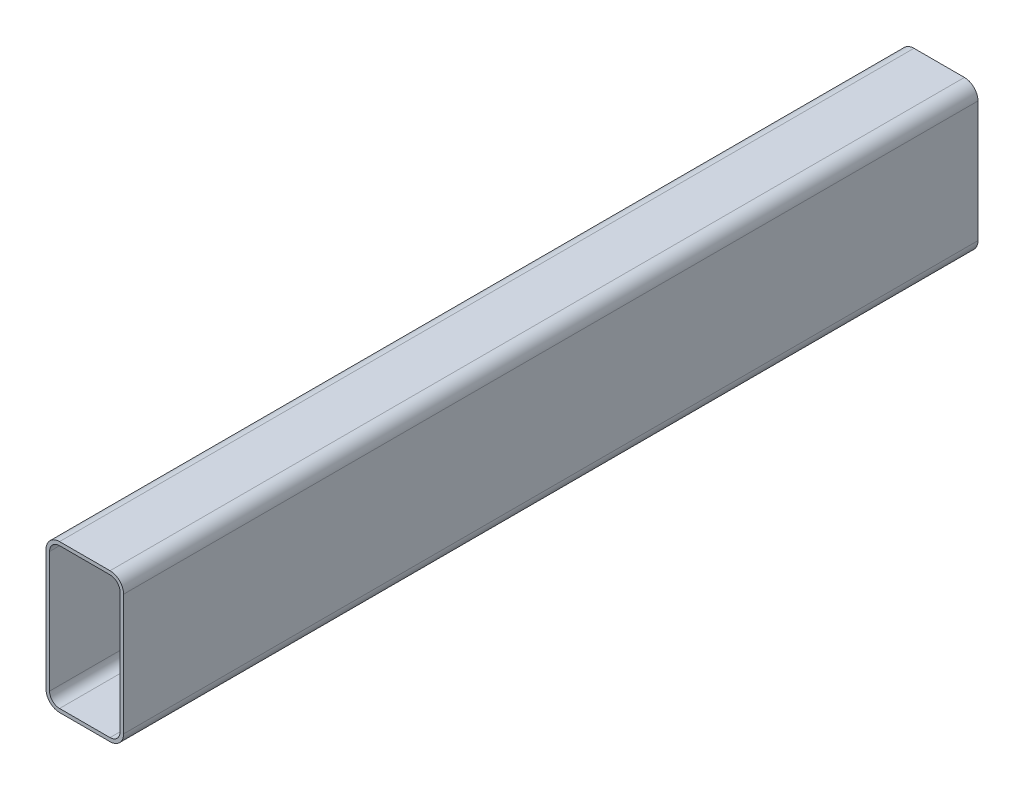
ISO-10303-21;
HEADER;
FILE_DESCRIPTION(('STEP AP214'),'2;1');
FILE_NAME('part.step','',(''),(''),'','','');
FILE_SCHEMA(('AUTOMOTIVE_DESIGN { 1 0 10303 214 1 1 1 1 }'));
ENDSEC;
DATA;
#1=APPLICATION_CONTEXT('core data for automotive mechanical design processes');
#2=APPLICATION_PROTOCOL_DEFINITION('international standard','automotive_design',2000,#1);
#3=PRODUCT_CONTEXT('',#1,'mechanical');
#4=PRODUCT('Part','Part','',(#3));
#5=PRODUCT_RELATED_PRODUCT_CATEGORY('part','',(#4));
#6=PRODUCT_DEFINITION_FORMATION('','',#4);
#7=PRODUCT_DEFINITION_CONTEXT('part definition',#1,'design');
#8=PRODUCT_DEFINITION('design','',#6,#7);
#9=PRODUCT_DEFINITION_SHAPE('','',#8);
#10=(LENGTH_UNIT() NAMED_UNIT(*) SI_UNIT(.MILLI.,.METRE.));
#11=(NAMED_UNIT(*) PLANE_ANGLE_UNIT() SI_UNIT($,.RADIAN.));
#12=(NAMED_UNIT(*) SI_UNIT($,.STERADIAN.) SOLID_ANGLE_UNIT());
#13=UNCERTAINTY_MEASURE_WITH_UNIT(LENGTH_MEASURE(1.E-05),#10,'distance_accuracy_value','');
#14=(GEOMETRIC_REPRESENTATION_CONTEXT(3) GLOBAL_UNCERTAINTY_ASSIGNED_CONTEXT((#13)) GLOBAL_UNIT_ASSIGNED_CONTEXT((#10,
#11,#12)) REPRESENTATION_CONTEXT('',''));
#15=CARTESIAN_POINT('',(0.,0.,0.));
#16=DIRECTION('',(0.,0.,1.));
#17=DIRECTION('',(1.,0.,0.));
#18=AXIS2_PLACEMENT_3D('',#15,#16,#17);
#19=CARTESIAN_POINT('',(9.001125,26.416,152.4));
#20=DIRECTION('',(0.,-1.,0.));
#21=DIRECTION('',(0.,0.,-1.));
#22=AXIS2_PLACEMENT_3D('',#19,#20,#21);
#23=PLANE('',#22);
#24=DIRECTION('',(0.,0.,-1.));
#25=VECTOR('',#24,1.);
#26=CARTESIAN_POINT('',(-9.001125,26.416,152.4));
#27=LINE('',#26,#25);
#28=CARTESIAN_POINT('',(-9.001125,26.416,152.4));
#29=VERTEX_POINT('',#28);
#30=CARTESIAN_POINT('',(-9.001125,26.416,-152.4));
#31=VERTEX_POINT('',#30);
#32=EDGE_CURVE('E118',#29,#31,#27,.T.);
#33=ORIENTED_EDGE('',*,*,#32,.F.);
#34=DIRECTION('',(1.,0.,0.));
#35=VECTOR('',#34,1.);
#36=CARTESIAN_POINT('',(9.001125,26.416,152.4));
#37=LINE('',#36,#35);
#38=CARTESIAN_POINT('',(9.001125,26.416,152.4));
#39=VERTEX_POINT('',#38);
#40=EDGE_CURVE('E115',#39,#29,#37,.F.);
#41=ORIENTED_EDGE('',*,*,#40,.F.);
#42=DIRECTION('',(0.,0.,-1.));
#43=VECTOR('',#42,1.);
#44=CARTESIAN_POINT('',(9.001125,26.416,152.4));
#45=LINE('',#44,#43);
#46=CARTESIAN_POINT('',(9.001125,26.416,-152.4));
#47=VERTEX_POINT('',#46);
#48=EDGE_CURVE('E103',#47,#39,#45,.F.);
#49=ORIENTED_EDGE('',*,*,#48,.F.);
#50=DIRECTION('',(1.,0.,0.));
#51=VECTOR('',#50,1.);
#52=CARTESIAN_POINT('',(9.001125,26.416,-152.4));
#53=LINE('',#52,#51);
#54=EDGE_CURVE('E188',#47,#31,#53,.F.);
#55=ORIENTED_EDGE('',*,*,#54,.T.);
#56=EDGE_LOOP('',(#33,#41,#49,#55));
#57=FACE_BOUND('',#56,.T.);
#58=ADVANCED_FACE('F15',(#57),#23,.F.);
#59=CARTESIAN_POINT('',(-9.001125,-26.416,152.4));
#60=DIRECTION('',(0.,1.,0.));
#61=DIRECTION('',(0.,0.,1.));
#62=AXIS2_PLACEMENT_3D('',#59,#60,#61);
#63=PLANE('',#62);
#64=DIRECTION('',(0.,0.,-1.));
#65=VECTOR('',#64,1.);
#66=CARTESIAN_POINT('',(9.001125,-26.416,152.4));
#67=LINE('',#66,#65);
#68=CARTESIAN_POINT('',(9.001125,-26.416,152.4));
#69=VERTEX_POINT('',#68);
#70=CARTESIAN_POINT('',(9.001125,-26.416,-152.4));
#71=VERTEX_POINT('',#70);
#72=EDGE_CURVE('E153',#69,#71,#67,.T.);
#73=ORIENTED_EDGE('',*,*,#72,.F.);
#74=DIRECTION('',(1.,0.,0.));
#75=VECTOR('',#74,1.);
#76=CARTESIAN_POINT('',(9.001125,-26.416,152.4));
#77=LINE('',#76,#75);
#78=CARTESIAN_POINT('',(-9.001125,-26.416,152.4));
#79=VERTEX_POINT('',#78);
#80=EDGE_CURVE('E122',#79,#69,#77,.T.);
#81=ORIENTED_EDGE('',*,*,#80,.F.);
#82=DIRECTION('',(0.,0.,-1.));
#83=VECTOR('',#82,1.);
#84=CARTESIAN_POINT('',(-9.001125,-26.416,152.4));
#85=LINE('',#84,#83);
#86=CARTESIAN_POINT('',(-9.001125,-26.416,-152.4));
#87=VERTEX_POINT('',#86);
#88=EDGE_CURVE('E156',#87,#79,#85,.F.);
#89=ORIENTED_EDGE('',*,*,#88,.F.);
#90=DIRECTION('',(1.,0.,0.));
#91=VECTOR('',#90,1.);
#92=CARTESIAN_POINT('',(9.001125,-26.416,-152.4));
#93=LINE('',#92,#91);
#94=EDGE_CURVE('E183',#87,#71,#93,.T.);
#95=ORIENTED_EDGE('',*,*,#94,.T.);
#96=EDGE_LOOP('',(#73,#81,#89,#95));
#97=FACE_BOUND('',#96,.T.);
#98=ADVANCED_FACE('F211',(#97),#63,.F.);
#99=CARTESIAN_POINT('',(9.001125,-21.574125,152.4));
#100=DIRECTION('',(0.,0.,-1.));
#101=DIRECTION('',(-1.,0.,0.));
#102=AXIS2_PLACEMENT_3D('',#99,#100,#101);
#103=CYLINDRICAL_SURFACE('',#102,4.841875);
#104=CARTESIAN_POINT('',(9.001125,-21.574125,152.4));
#105=DIRECTION('',(0.,0.,-1.));
#106=DIRECTION('',(-1.,0.,0.));
#107=AXIS2_PLACEMENT_3D('',#104,#105,#106);
#108=CIRCLE('',#107,4.841875);
#109=CARTESIAN_POINT('',(13.843,-21.574125,152.4));
#110=VERTEX_POINT('',#109);
#111=EDGE_CURVE('E203',#69,#110,#108,.F.);
#112=ORIENTED_EDGE('',*,*,#111,.F.);
#113=ORIENTED_EDGE('',*,*,#72,.T.);
#114=CARTESIAN_POINT('',(9.001125,-21.574125,-152.4));
#115=DIRECTION('',(0.,0.,-1.));
#116=DIRECTION('',(-1.,0.,0.));
#117=AXIS2_PLACEMENT_3D('',#114,#115,#116);
#118=CIRCLE('',#117,4.841875);
#119=CARTESIAN_POINT('',(13.843,-21.574125,-152.4));
#120=VERTEX_POINT('',#119);
#121=EDGE_CURVE('E180',#71,#120,#118,.F.);
#122=ORIENTED_EDGE('',*,*,#121,.T.);
#123=DIRECTION('',(0.,0.,1.));
#124=VECTOR('',#123,1.);
#125=CARTESIAN_POINT('',(13.843,-21.574125,152.4));
#126=LINE('',#125,#124);
#127=EDGE_CURVE('E111',#120,#110,#126,.T.);
#128=ORIENTED_EDGE('',*,*,#127,.T.);
#129=EDGE_LOOP('',(#112,#113,#122,#128));
#130=FACE_BOUND('',#129,.T.);
#131=ADVANCED_FACE('F214',(#130),#103,.T.);
#132=CARTESIAN_POINT('',(13.843,21.574125,152.4));
#133=DIRECTION('',(-1.,0.,0.));
#134=DIRECTION('',(0.,0.,1.));
#135=AXIS2_PLACEMENT_3D('',#132,#133,#134);
#136=PLANE('',#135);
#137=DIRECTION('',(0.,0.,-1.));
#138=VECTOR('',#137,1.);
#139=CARTESIAN_POINT('',(13.843,21.574125,152.4));
#140=LINE('',#139,#138);
#141=CARTESIAN_POINT('',(13.843,21.574125,152.4));
#142=VERTEX_POINT('',#141);
#143=CARTESIAN_POINT('',(13.843,21.574125,-152.4));
#144=VERTEX_POINT('',#143);
#145=EDGE_CURVE('E96',#142,#144,#140,.T.);
#146=ORIENTED_EDGE('',*,*,#145,.F.);
#147=DIRECTION('',(0.,1.,0.));
#148=VECTOR('',#147,1.);
#149=CARTESIAN_POINT('',(13.843,21.574125,152.4));
#150=LINE('',#149,#148);
#151=EDGE_CURVE('E117',#110,#142,#150,.T.);
#152=ORIENTED_EDGE('',*,*,#151,.F.);
#153=ORIENTED_EDGE('',*,*,#127,.F.);
#154=DIRECTION('',(0.,1.,0.));
#155=VECTOR('',#154,1.);
#156=CARTESIAN_POINT('',(13.843,21.574125,-152.4));
#157=LINE('',#156,#155);
#158=EDGE_CURVE('E179',#120,#144,#157,.T.);
#159=ORIENTED_EDGE('',*,*,#158,.T.);
#160=EDGE_LOOP('',(#146,#152,#153,#159));
#161=FACE_BOUND('',#160,.T.);
#162=ADVANCED_FACE('F217',(#161),#136,.F.);
#163=CARTESIAN_POINT('',(9.001125,21.574125,152.4));
#164=DIRECTION('',(0.,0.,-1.));
#165=DIRECTION('',(-1.,0.,0.));
#166=AXIS2_PLACEMENT_3D('',#163,#164,#165);
#167=CYLINDRICAL_SURFACE('',#166,4.841875);
#168=CARTESIAN_POINT('',(9.001125,21.574125,152.4));
#169=DIRECTION('',(0.,0.,-1.));
#170=DIRECTION('',(-1.,0.,0.));
#171=AXIS2_PLACEMENT_3D('',#168,#169,#170);
#172=CIRCLE('',#171,4.841875);
#173=EDGE_CURVE('E18',#142,#39,#172,.F.);
#174=ORIENTED_EDGE('',*,*,#173,.F.);
#175=ORIENTED_EDGE('',*,*,#145,.T.);
#176=CARTESIAN_POINT('',(9.001125,21.574125,-152.4));
#177=DIRECTION('',(0.,0.,-1.));
#178=DIRECTION('',(-1.,0.,0.));
#179=AXIS2_PLACEMENT_3D('',#176,#177,#178);
#180=CIRCLE('',#179,4.841875);
#181=EDGE_CURVE('E107',#144,#47,#180,.F.);
#182=ORIENTED_EDGE('',*,*,#181,.T.);
#183=ORIENTED_EDGE('',*,*,#48,.T.);
#184=EDGE_LOOP('',(#174,#175,#182,#183));
#185=FACE_BOUND('',#184,.T.);
#186=ADVANCED_FACE('F105',(#185),#167,.T.);
#187=CARTESIAN_POINT('',(9.001125,25.146,152.4));
#188=DIRECTION('',(0.,-1.,0.));
#189=DIRECTION('',(0.,0.,-1.));
#190=AXIS2_PLACEMENT_3D('',#187,#188,#189);
#191=PLANE('',#190);
#192=DIRECTION('',(1.,0.,0.));
#193=VECTOR('',#192,1.);
#194=CARTESIAN_POINT('',(9.001125,25.146,152.4));
#195=LINE('',#194,#193);
#196=CARTESIAN_POINT('',(-9.001125,25.146,152.4));
#197=VERTEX_POINT('',#196);
#198=CARTESIAN_POINT('',(9.001125,25.146,152.4));
#199=VERTEX_POINT('',#198);
#200=EDGE_CURVE('E198',#197,#199,#195,.T.);
#201=ORIENTED_EDGE('',*,*,#200,.F.);
#202=DIRECTION('',(0.,0.,-1.));
#203=VECTOR('',#202,1.);
#204=CARTESIAN_POINT('',(-9.001125,25.146,152.4));
#205=LINE('',#204,#203);
#206=CARTESIAN_POINT('',(-9.001125,25.146,-152.4));
#207=VERTEX_POINT('',#206);
#208=EDGE_CURVE('E126',#197,#207,#205,.T.);
#209=ORIENTED_EDGE('',*,*,#208,.T.);
#210=DIRECTION('',(1.,0.,0.));
#211=VECTOR('',#210,1.);
#212=CARTESIAN_POINT('',(9.001125,25.146,-152.4));
#213=LINE('',#212,#211);
#214=CARTESIAN_POINT('',(9.001125,25.146,-152.4));
#215=VERTEX_POINT('',#214);
#216=EDGE_CURVE('E177',#207,#215,#213,.T.);
#217=ORIENTED_EDGE('',*,*,#216,.T.);
#218=DIRECTION('',(0.,0.,-1.));
#219=VECTOR('',#218,1.);
#220=CARTESIAN_POINT('',(9.001125,25.146,152.4));
#221=LINE('',#220,#219);
#222=EDGE_CURVE('E147',#215,#199,#221,.F.);
#223=ORIENTED_EDGE('',*,*,#222,.T.);
#224=EDGE_LOOP('',(#201,#209,#217,#223));
#225=FACE_BOUND('',#224,.T.);
#226=ADVANCED_FACE('F225',(#225),#191,.T.);
#227=CARTESIAN_POINT('',(9.001125,21.574125,152.4));
#228=DIRECTION('',(0.,0.,-1.));
#229=DIRECTION('',(-1.,0.,0.));
#230=AXIS2_PLACEMENT_3D('',#227,#228,#229);
#231=CYLINDRICAL_SURFACE('',#230,3.571875);
#232=DIRECTION('',(0.,0.,1.));
#233=VECTOR('',#232,1.);
#234=CARTESIAN_POINT('',(12.573,21.574125,152.4));
#235=LINE('',#234,#233);
#236=CARTESIAN_POINT('',(12.573,21.574125,152.4));
#237=VERTEX_POINT('',#236);
#238=CARTESIAN_POINT('',(12.573,21.574125,-152.4));
#239=VERTEX_POINT('',#238);
#240=EDGE_CURVE('E144',#237,#239,#235,.F.);
#241=ORIENTED_EDGE('',*,*,#240,.F.);
#242=CARTESIAN_POINT('',(9.001125,21.574125,152.4));
#243=DIRECTION('',(0.,0.,-1.));
#244=DIRECTION('',(-1.,0.,0.));
#245=AXIS2_PLACEMENT_3D('',#242,#243,#244);
#246=CIRCLE('',#245,3.571875);
#247=EDGE_CURVE('E196',#199,#237,#246,.T.);
#248=ORIENTED_EDGE('',*,*,#247,.F.);
#249=ORIENTED_EDGE('',*,*,#222,.F.);
#250=CARTESIAN_POINT('',(9.001125,21.574125,-152.4));
#251=DIRECTION('',(0.,0.,-1.));
#252=DIRECTION('',(-1.,0.,0.));
#253=AXIS2_PLACEMENT_3D('',#250,#251,#252);
#254=CIRCLE('',#253,3.571875);
#255=EDGE_CURVE('E174',#215,#239,#254,.T.);
#256=ORIENTED_EDGE('',*,*,#255,.T.);
#257=EDGE_LOOP('',(#241,#248,#249,#256));
#258=FACE_BOUND('',#257,.T.);
#259=ADVANCED_FACE('F274',(#258),#231,.F.);
#260=CARTESIAN_POINT('',(12.573,21.574125,152.4));
#261=DIRECTION('',(-1.,0.,0.));
#262=DIRECTION('',(0.,0.,1.));
#263=AXIS2_PLACEMENT_3D('',#260,#261,#262);
#264=PLANE('',#263);
#265=DIRECTION('',(0.,1.,0.));
#266=VECTOR('',#265,1.);
#267=CARTESIAN_POINT('',(12.573,21.574125,152.4));
#268=LINE('',#267,#266);
#269=CARTESIAN_POINT('',(12.573,-21.574125,152.4));
#270=VERTEX_POINT('',#269);
#271=EDGE_CURVE('E195',#237,#270,#268,.F.);
#272=ORIENTED_EDGE('',*,*,#271,.F.);
#273=ORIENTED_EDGE('',*,*,#240,.T.);
#274=DIRECTION('',(0.,1.,0.));
#275=VECTOR('',#274,1.);
#276=CARTESIAN_POINT('',(12.573,21.574125,-152.4));
#277=LINE('',#276,#275);
#278=CARTESIAN_POINT('',(12.573,-21.574125,-152.4));
#279=VERTEX_POINT('',#278);
#280=EDGE_CURVE('E173',#239,#279,#277,.F.);
#281=ORIENTED_EDGE('',*,*,#280,.T.);
#282=DIRECTION('',(0.,0.,-1.));
#283=VECTOR('',#282,1.);
#284=CARTESIAN_POINT('',(12.573,-21.574125,152.4));
#285=LINE('',#284,#283);
#286=EDGE_CURVE('E141',#279,#270,#285,.F.);
#287=ORIENTED_EDGE('',*,*,#286,.T.);
#288=EDGE_LOOP('',(#272,#273,#281,#287));
#289=FACE_BOUND('',#288,.T.);
#290=ADVANCED_FACE('F270',(#289),#264,.T.);
#291=CARTESIAN_POINT('',(9.001125,-21.574125,152.4));
#292=DIRECTION('',(0.,0.,-1.));
#293=DIRECTION('',(-1.,0.,0.));
#294=AXIS2_PLACEMENT_3D('',#291,#292,#293);
#295=CYLINDRICAL_SURFACE('',#294,3.571875);
#296=DIRECTION('',(0.,0.,1.));
#297=VECTOR('',#296,1.);
#298=CARTESIAN_POINT('',(9.001125,-25.146,152.4));
#299=LINE('',#298,#297);
#300=CARTESIAN_POINT('',(9.001125,-25.146,152.4));
#301=VERTEX_POINT('',#300);
#302=CARTESIAN_POINT('',(9.001125,-25.146,-152.4));
#303=VERTEX_POINT('',#302);
#304=EDGE_CURVE('E138',#301,#303,#299,.F.);
#305=ORIENTED_EDGE('',*,*,#304,.F.);
#306=CARTESIAN_POINT('',(9.001125,-21.574125,152.4));
#307=DIRECTION('',(0.,0.,-1.));
#308=DIRECTION('',(-1.,0.,0.));
#309=AXIS2_PLACEMENT_3D('',#306,#307,#308);
#310=CIRCLE('',#309,3.571875);
#311=EDGE_CURVE('E193',#270,#301,#310,.T.);
#312=ORIENTED_EDGE('',*,*,#311,.F.);
#313=ORIENTED_EDGE('',*,*,#286,.F.);
#314=CARTESIAN_POINT('',(9.001125,-21.574125,-152.4));
#315=DIRECTION('',(0.,0.,-1.));
#316=DIRECTION('',(-1.,0.,0.));
#317=AXIS2_PLACEMENT_3D('',#314,#315,#316);
#318=CIRCLE('',#317,3.571875);
#319=EDGE_CURVE('E170',#279,#303,#318,.T.);
#320=ORIENTED_EDGE('',*,*,#319,.T.);
#321=EDGE_LOOP('',(#305,#312,#313,#320));
#322=FACE_BOUND('',#321,.T.);
#323=ADVANCED_FACE('F266',(#322),#295,.F.);
#324=CARTESIAN_POINT('',(-9.001125,-25.146,152.4));
#325=DIRECTION('',(0.,1.,0.));
#326=DIRECTION('',(0.,0.,1.));
#327=AXIS2_PLACEMENT_3D('',#324,#325,#326);
#328=PLANE('',#327);
#329=DIRECTION('',(1.,0.,0.));
#330=VECTOR('',#329,1.);
#331=CARTESIAN_POINT('',(9.001125,-25.146,152.4));
#332=LINE('',#331,#330);
#333=CARTESIAN_POINT('',(-9.001125,-25.146,152.4));
#334=VERTEX_POINT('',#333);
#335=EDGE_CURVE('E192',#301,#334,#332,.F.);
#336=ORIENTED_EDGE('',*,*,#335,.F.);
#337=ORIENTED_EDGE('',*,*,#304,.T.);
#338=DIRECTION('',(1.,0.,0.));
#339=VECTOR('',#338,1.);
#340=CARTESIAN_POINT('',(9.001125,-25.146,-152.4));
#341=LINE('',#340,#339);
#342=CARTESIAN_POINT('',(-9.001125,-25.146,-152.4));
#343=VERTEX_POINT('',#342);
#344=EDGE_CURVE('E169',#303,#343,#341,.F.);
#345=ORIENTED_EDGE('',*,*,#344,.T.);
#346=DIRECTION('',(0.,0.,-1.));
#347=VECTOR('',#346,1.);
#348=CARTESIAN_POINT('',(-9.001125,-25.146,152.4));
#349=LINE('',#348,#347);
#350=EDGE_CURVE('E135',#343,#334,#349,.F.);
#351=ORIENTED_EDGE('',*,*,#350,.T.);
#352=EDGE_LOOP('',(#336,#337,#345,#351));
#353=FACE_BOUND('',#352,.T.);
#354=ADVANCED_FACE('F262',(#353),#328,.T.);
#355=CARTESIAN_POINT('',(-9.001125,-21.574125,152.4));
#356=DIRECTION('',(0.,0.,-1.));
#357=DIRECTION('',(-1.,0.,0.));
#358=AXIS2_PLACEMENT_3D('',#355,#356,#357);
#359=CYLINDRICAL_SURFACE('',#358,3.571875);
#360=DIRECTION('',(0.,0.,-1.));
#361=VECTOR('',#360,1.);
#362=CARTESIAN_POINT('',(-12.573,-21.574125,152.4));
#363=LINE('',#362,#361);
#364=CARTESIAN_POINT('',(-12.573,-21.574125,152.4));
#365=VERTEX_POINT('',#364);
#366=CARTESIAN_POINT('',(-12.573,-21.574125,-152.4));
#367=VERTEX_POINT('',#366);
#368=EDGE_CURVE('E132',#365,#367,#363,.T.);
#369=ORIENTED_EDGE('',*,*,#368,.F.);
#370=CARTESIAN_POINT('',(-9.001125,-21.574125,152.4));
#371=DIRECTION('',(0.,0.,-1.));
#372=DIRECTION('',(-1.,0.,0.));
#373=AXIS2_PLACEMENT_3D('',#370,#371,#372);
#374=CIRCLE('',#373,3.571875);
#375=EDGE_CURVE('E159',#334,#365,#374,.T.);
#376=ORIENTED_EDGE('',*,*,#375,.F.);
#377=ORIENTED_EDGE('',*,*,#350,.F.);
#378=CARTESIAN_POINT('',(-9.001125,-21.574125,-152.4));
#379=DIRECTION('',(0.,0.,-1.));
#380=DIRECTION('',(-1.,0.,0.));
#381=AXIS2_PLACEMENT_3D('',#378,#379,#380);
#382=CIRCLE('',#381,3.571875);
#383=EDGE_CURVE('E166',#343,#367,#382,.T.);
#384=ORIENTED_EDGE('',*,*,#383,.T.);
#385=EDGE_LOOP('',(#369,#376,#377,#384));
#386=FACE_BOUND('',#385,.T.);
#387=ADVANCED_FACE('F258',(#386),#359,.F.);
#388=CARTESIAN_POINT('',(-12.573,-21.574125,152.4));
#389=DIRECTION('',(1.,0.,0.));
#390=DIRECTION('',(0.,0.,-1.));
#391=AXIS2_PLACEMENT_3D('',#388,#389,#390);
#392=PLANE('',#391);
#393=DIRECTION('',(0.,1.,0.));
#394=VECTOR('',#393,1.);
#395=CARTESIAN_POINT('',(-12.573,21.574125,152.4));
#396=LINE('',#395,#394);
#397=CARTESIAN_POINT('',(-12.573,21.574125,152.4));
#398=VERTEX_POINT('',#397);
#399=EDGE_CURVE('E202',#365,#398,#396,.T.);
#400=ORIENTED_EDGE('',*,*,#399,.F.);
#401=ORIENTED_EDGE('',*,*,#368,.T.);
#402=DIRECTION('',(0.,1.,0.));
#403=VECTOR('',#402,1.);
#404=CARTESIAN_POINT('',(-12.573,21.574125,-152.4));
#405=LINE('',#404,#403);
#406=CARTESIAN_POINT('',(-12.573,21.574125,-152.4));
#407=VERTEX_POINT('',#406);
#408=EDGE_CURVE('E165',#367,#407,#405,.T.);
#409=ORIENTED_EDGE('',*,*,#408,.T.);
#410=DIRECTION('',(0.,0.,-1.));
#411=VECTOR('',#410,1.);
#412=CARTESIAN_POINT('',(-12.573,21.574125,152.4));
#413=LINE('',#412,#411);
#414=EDGE_CURVE('E129',#407,#398,#413,.F.);
#415=ORIENTED_EDGE('',*,*,#414,.T.);
#416=EDGE_LOOP('',(#400,#401,#409,#415));
#417=FACE_BOUND('',#416,.T.);
#418=ADVANCED_FACE('F254',(#417),#392,.T.);
#419=CARTESIAN_POINT('',(-9.001125,21.574125,152.4));
#420=DIRECTION('',(0.,0.,-1.));
#421=DIRECTION('',(-1.,0.,0.));
#422=AXIS2_PLACEMENT_3D('',#419,#420,#421);
#423=CYLINDRICAL_SURFACE('',#422,3.571875);
#424=ORIENTED_EDGE('',*,*,#208,.F.);
#425=CARTESIAN_POINT('',(-9.001125,21.574125,152.4));
#426=DIRECTION('',(0.,0.,-1.));
#427=DIRECTION('',(-1.,0.,0.));
#428=AXIS2_PLACEMENT_3D('',#425,#426,#427);
#429=CIRCLE('',#428,3.571875);
#430=EDGE_CURVE('E199',#398,#197,#429,.T.);
#431=ORIENTED_EDGE('',*,*,#430,.F.);
#432=ORIENTED_EDGE('',*,*,#414,.F.);
#433=CARTESIAN_POINT('',(-9.001125,21.574125,-152.4));
#434=DIRECTION('',(0.,0.,-1.));
#435=DIRECTION('',(-1.,0.,0.));
#436=AXIS2_PLACEMENT_3D('',#433,#434,#435);
#437=CIRCLE('',#436,3.571875);
#438=EDGE_CURVE('E161',#407,#207,#437,.T.);
#439=ORIENTED_EDGE('',*,*,#438,.T.);
#440=EDGE_LOOP('',(#424,#431,#432,#439));
#441=FACE_BOUND('',#440,.T.);
#442=ADVANCED_FACE('F250',(#441),#423,.F.);
#443=CARTESIAN_POINT('',(-9.001125,21.574125,152.4));
#444=DIRECTION('',(0.,0.,-1.));
#445=DIRECTION('',(-1.,0.,0.));
#446=AXIS2_PLACEMENT_3D('',#443,#444,#445);
#447=CYLINDRICAL_SURFACE('',#446,4.841875);
#448=CARTESIAN_POINT('',(-9.001125,21.574125,152.4));
#449=DIRECTION('',(0.,0.,-1.));
#450=DIRECTION('',(-1.,0.,0.));
#451=AXIS2_PLACEMENT_3D('',#448,#449,#450);
#452=CIRCLE('',#451,4.841875);
#453=CARTESIAN_POINT('',(-13.843,21.574125,152.4));
#454=VERTEX_POINT('',#453);
#455=EDGE_CURVE('E120',#29,#454,#452,.F.);
#456=ORIENTED_EDGE('',*,*,#455,.F.);
#457=ORIENTED_EDGE('',*,*,#32,.T.);
#458=CARTESIAN_POINT('',(-9.001125,21.574125,-152.4));
#459=DIRECTION('',(0.,0.,-1.));
#460=DIRECTION('',(-1.,0.,0.));
#461=AXIS2_PLACEMENT_3D('',#458,#459,#460);
#462=CIRCLE('',#461,4.841875);
#463=CARTESIAN_POINT('',(-13.843,21.574125,-152.4));
#464=VERTEX_POINT('',#463);
#465=EDGE_CURVE('E185',#31,#464,#462,.F.);
#466=ORIENTED_EDGE('',*,*,#465,.T.);
#467=DIRECTION('',(0.,0.,-1.));
#468=VECTOR('',#467,1.);
#469=CARTESIAN_POINT('',(-13.843,21.574125,152.4));
#470=LINE('',#469,#468);
#471=EDGE_CURVE('E164',#464,#454,#470,.F.);
#472=ORIENTED_EDGE('',*,*,#471,.T.);
#473=EDGE_LOOP('',(#456,#457,#466,#472));
#474=FACE_BOUND('',#473,.T.);
#475=ADVANCED_FACE('F246',(#474),#447,.T.);
#476=CARTESIAN_POINT('',(9.001125,21.574125,152.4));
#477=DIRECTION('',(0.,0.,1.));
#478=DIRECTION('',(1.,0.,0.));
#479=AXIS2_PLACEMENT_3D('',#476,#477,#478);
#480=PLANE('',#479);
#481=ORIENTED_EDGE('',*,*,#335,.T.);
#482=ORIENTED_EDGE('',*,*,#375,.T.);
#483=ORIENTED_EDGE('',*,*,#399,.T.);
#484=ORIENTED_EDGE('',*,*,#430,.T.);
#485=ORIENTED_EDGE('',*,*,#200,.T.);
#486=ORIENTED_EDGE('',*,*,#247,.T.);
#487=ORIENTED_EDGE('',*,*,#271,.T.);
#488=ORIENTED_EDGE('',*,*,#311,.T.);
#489=EDGE_LOOP('',(#481,#482,#483,#484,#485,#486,#487,#488));
#490=FACE_BOUND('',#489,.T.);
#491=ORIENTED_EDGE('',*,*,#111,.T.);
#492=ORIENTED_EDGE('',*,*,#151,.T.);
#493=ORIENTED_EDGE('',*,*,#173,.T.);
#494=ORIENTED_EDGE('',*,*,#40,.T.);
#495=ORIENTED_EDGE('',*,*,#455,.T.);
#496=DIRECTION('',(0.,1.,0.));
#497=VECTOR('',#496,1.);
#498=CARTESIAN_POINT('',(-13.843,-21.574125,152.4));
#499=LINE('',#498,#497);
#500=CARTESIAN_POINT('',(-13.843,-21.574125,152.4));
#501=VERTEX_POINT('',#500);
#502=EDGE_CURVE('E328',#454,#501,#499,.F.);
#503=ORIENTED_EDGE('',*,*,#502,.T.);
#504=CARTESIAN_POINT('',(-9.001125,-21.574125,152.4));
#505=DIRECTION('',(0.,0.,-1.));
#506=DIRECTION('',(-1.,0.,0.));
#507=AXIS2_PLACEMENT_3D('',#504,#505,#506);
#508=CIRCLE('',#507,4.841875);
#509=EDGE_CURVE('E158',#79,#501,#508,.T.);
#510=ORIENTED_EDGE('',*,*,#509,.F.);
#511=ORIENTED_EDGE('',*,*,#80,.T.);
#512=EDGE_LOOP('',(#491,#492,#493,#494,#495,#503,#510,#511));
#513=FACE_BOUND('',#512,.T.);
#514=ADVANCED_FACE('F114',(#490,#513),#480,.T.);
#515=CARTESIAN_POINT('',(-9.001125,-21.574125,152.4));
#516=DIRECTION('',(0.,0.,-1.));
#517=DIRECTION('',(-1.,0.,0.));
#518=AXIS2_PLACEMENT_3D('',#515,#516,#517);
#519=CYLINDRICAL_SURFACE('',#518,4.841875);
#520=ORIENTED_EDGE('',*,*,#509,.T.);
#521=DIRECTION('',(0.,0.,-1.));
#522=VECTOR('',#521,1.);
#523=CARTESIAN_POINT('',(-13.843,-21.574125,152.4));
#524=LINE('',#523,#522);
#525=CARTESIAN_POINT('',(-13.843,-21.574125,-152.4));
#526=VERTEX_POINT('',#525);
#527=EDGE_CURVE('E24',#501,#526,#524,.T.);
#528=ORIENTED_EDGE('',*,*,#527,.T.);
#529=CARTESIAN_POINT('',(-9.001125,-21.574125,-152.4));
#530=DIRECTION('',(0.,0.,-1.));
#531=DIRECTION('',(-1.,0.,0.));
#532=AXIS2_PLACEMENT_3D('',#529,#530,#531);
#533=CIRCLE('',#532,4.841875);
#534=EDGE_CURVE('E32',#526,#87,#533,.F.);
#535=ORIENTED_EDGE('',*,*,#534,.T.);
#536=ORIENTED_EDGE('',*,*,#88,.T.);
#537=EDGE_LOOP('',(#520,#528,#535,#536));
#538=FACE_BOUND('',#537,.T.);
#539=ADVANCED_FACE('F236',(#538),#519,.T.);
#540=CARTESIAN_POINT('',(9.001125,21.574125,-152.4));
#541=DIRECTION('',(0.,0.,1.));
#542=DIRECTION('',(1.,0.,0.));
#543=AXIS2_PLACEMENT_3D('',#540,#541,#542);
#544=PLANE('',#543);
#545=ORIENTED_EDGE('',*,*,#408,.F.);
#546=ORIENTED_EDGE('',*,*,#383,.F.);
#547=ORIENTED_EDGE('',*,*,#344,.F.);
#548=ORIENTED_EDGE('',*,*,#319,.F.);
#549=ORIENTED_EDGE('',*,*,#280,.F.);
#550=ORIENTED_EDGE('',*,*,#255,.F.);
#551=ORIENTED_EDGE('',*,*,#216,.F.);
#552=ORIENTED_EDGE('',*,*,#438,.F.);
#553=EDGE_LOOP('',(#545,#546,#547,#548,#549,#550,#551,#552));
#554=FACE_BOUND('',#553,.T.);
#555=ORIENTED_EDGE('',*,*,#158,.F.);
#556=ORIENTED_EDGE('',*,*,#121,.F.);
#557=ORIENTED_EDGE('',*,*,#94,.F.);
#558=ORIENTED_EDGE('',*,*,#534,.F.);
#559=DIRECTION('',(0.,1.,0.));
#560=VECTOR('',#559,1.);
#561=CARTESIAN_POINT('',(-13.843,-21.574125,-152.4));
#562=LINE('',#561,#560);
#563=EDGE_CURVE('E9',#526,#464,#562,.T.);
#564=ORIENTED_EDGE('',*,*,#563,.T.);
#565=ORIENTED_EDGE('',*,*,#465,.F.);
#566=ORIENTED_EDGE('',*,*,#54,.F.);
#567=ORIENTED_EDGE('',*,*,#181,.F.);
#568=EDGE_LOOP('',(#555,#556,#557,#558,#564,#565,#566,#567));
#569=FACE_BOUND('',#568,.T.);
#570=ADVANCED_FACE('F230',(#554,#569),#544,.F.);
#571=CARTESIAN_POINT('',(-13.843,-21.574125,152.4));
#572=DIRECTION('',(1.,0.,0.));
#573=DIRECTION('',(0.,0.,-1.));
#574=AXIS2_PLACEMENT_3D('',#571,#572,#573);
#575=PLANE('',#574);
#576=ORIENTED_EDGE('',*,*,#527,.F.);
#577=ORIENTED_EDGE('',*,*,#502,.F.);
#578=ORIENTED_EDGE('',*,*,#471,.F.);
#579=ORIENTED_EDGE('',*,*,#563,.F.);
#580=EDGE_LOOP('',(#576,#577,#578,#579));
#581=FACE_BOUND('',#580,.T.);
#582=ADVANCED_FACE('F228',(#581),#575,.F.);
#583=CLOSED_SHELL('',(#58,#98,#131,#162,#186,#226,#259,#290,#323,#354,#387,#418,#442,#475,#514,
#539,#570,#582));
#584=MANIFOLD_SOLID_BREP('B1',#583);
#585=ADVANCED_BREP_SHAPE_REPRESENTATION('',(#18,#584),#14);
#586=SHAPE_DEFINITION_REPRESENTATION(#9,#585);
ENDSEC;
END-ISO-10303-21;
